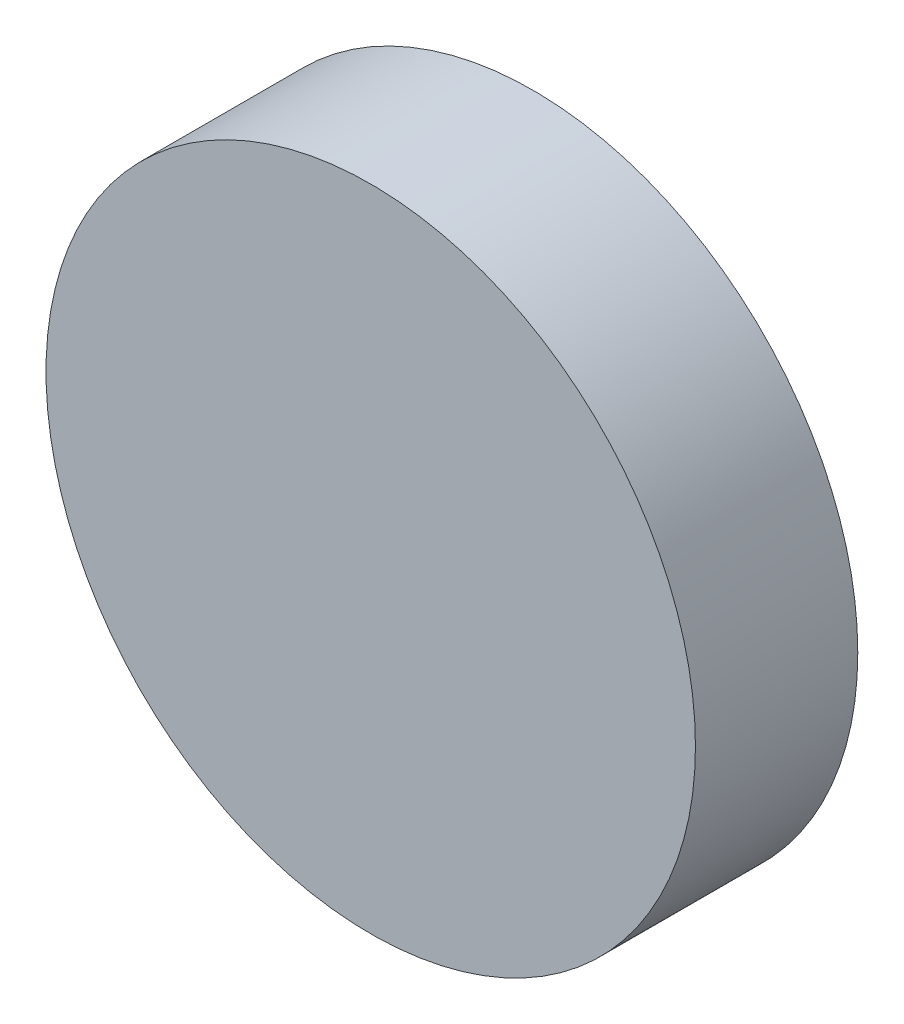
ISO-10303-21;
HEADER;
FILE_DESCRIPTION(('STEP AP214'),'2;1');
FILE_NAME('part.step','',(''),(''),'','','');
FILE_SCHEMA(('AUTOMOTIVE_DESIGN { 1 0 10303 214 1 1 1 1 }'));
ENDSEC;
DATA;
#1=APPLICATION_CONTEXT('core data for automotive mechanical design processes');
#2=APPLICATION_PROTOCOL_DEFINITION('international standard','automotive_design',2000,#1);
#3=PRODUCT_CONTEXT('',#1,'mechanical');
#4=PRODUCT('Part','Part','',(#3));
#5=PRODUCT_RELATED_PRODUCT_CATEGORY('part','',(#4));
#6=PRODUCT_DEFINITION_FORMATION('','',#4);
#7=PRODUCT_DEFINITION_CONTEXT('part definition',#1,'design');
#8=PRODUCT_DEFINITION('design','',#6,#7);
#9=PRODUCT_DEFINITION_SHAPE('','',#8);
#10=(LENGTH_UNIT() NAMED_UNIT(*) SI_UNIT(.MILLI.,.METRE.));
#11=(NAMED_UNIT(*) PLANE_ANGLE_UNIT() SI_UNIT($,.RADIAN.));
#12=(NAMED_UNIT(*) SI_UNIT($,.STERADIAN.) SOLID_ANGLE_UNIT());
#13=UNCERTAINTY_MEASURE_WITH_UNIT(LENGTH_MEASURE(1.E-05),#10,'distance_accuracy_value','');
#14=(GEOMETRIC_REPRESENTATION_CONTEXT(3) GLOBAL_UNCERTAINTY_ASSIGNED_CONTEXT((#13)) GLOBAL_UNIT_ASSIGNED_CONTEXT((#10,
#11,#12)) REPRESENTATION_CONTEXT('',''));
#15=CARTESIAN_POINT('',(0.,0.,0.));
#16=DIRECTION('',(0.,0.,1.));
#17=DIRECTION('',(1.,0.,0.));
#18=AXIS2_PLACEMENT_3D('',#15,#16,#17);
#19=CARTESIAN_POINT('',(0.,0.,2.));
#20=DIRECTION('',(0.,0.,-1.));
#21=DIRECTION('',(-1.,0.,0.));
#22=AXIS2_PLACEMENT_3D('',#19,#20,#21);
#23=CYLINDRICAL_SURFACE('',#22,4.);
#24=CARTESIAN_POINT('',(0.,0.,2.));
#25=DIRECTION('',(0.,0.,1.));
#26=DIRECTION('',(1.,0.,0.));
#27=AXIS2_PLACEMENT_3D('',#24,#25,#26);
#28=CIRCLE('',#27,4.);
#29=CARTESIAN_POINT('',(4.,0.,2.));
#30=VERTEX_POINT('',#29);
#31=EDGE_CURVE('E10',#30,#30,#28,.T.);
#32=ORIENTED_EDGE('',*,*,#31,.F.);
#33=EDGE_LOOP('',(#32));
#34=FACE_BOUND('',#33,.T.);
#35=CARTESIAN_POINT('',(0.,0.,0.));
#36=DIRECTION('',(0.,0.,1.));
#37=DIRECTION('',(1.,0.,0.));
#38=AXIS2_PLACEMENT_3D('',#35,#36,#37);
#39=CIRCLE('',#38,4.);
#40=CARTESIAN_POINT('',(4.,0.,0.));
#41=VERTEX_POINT('',#40);
#42=EDGE_CURVE('E34',#41,#41,#39,.T.);
#43=ORIENTED_EDGE('',*,*,#42,.T.);
#44=EDGE_LOOP('',(#43));
#45=FACE_BOUND('',#44,.T.);
#46=ADVANCED_FACE('F31',(#34,#45),#23,.T.);
#47=CARTESIAN_POINT('',(0.,0.,2.));
#48=DIRECTION('',(0.,0.,1.));
#49=DIRECTION('',(1.,0.,0.));
#50=AXIS2_PLACEMENT_3D('',#47,#48,#49);
#51=PLANE('',#50);
#52=ORIENTED_EDGE('',*,*,#31,.T.);
#53=EDGE_LOOP('',(#52));
#54=FACE_BOUND('',#53,.T.);
#55=ADVANCED_FACE('F46',(#54),#51,.T.);
#56=CARTESIAN_POINT('',(0.,0.,0.));
#57=DIRECTION('',(0.,0.,1.));
#58=DIRECTION('',(1.,0.,0.));
#59=AXIS2_PLACEMENT_3D('',#56,#57,#58);
#60=PLANE('',#59);
#61=ORIENTED_EDGE('',*,*,#42,.F.);
#62=EDGE_LOOP('',(#61));
#63=FACE_BOUND('',#62,.T.);
#64=ADVANCED_FACE('F44',(#63),#60,.F.);
#65=CLOSED_SHELL('',(#46,#55,#64));
#66=MANIFOLD_SOLID_BREP('B2',#65);
#67=ADVANCED_BREP_SHAPE_REPRESENTATION('',(#18,#66),#14);
#68=SHAPE_DEFINITION_REPRESENTATION(#9,#67);
ENDSEC;
END-ISO-10303-21;
